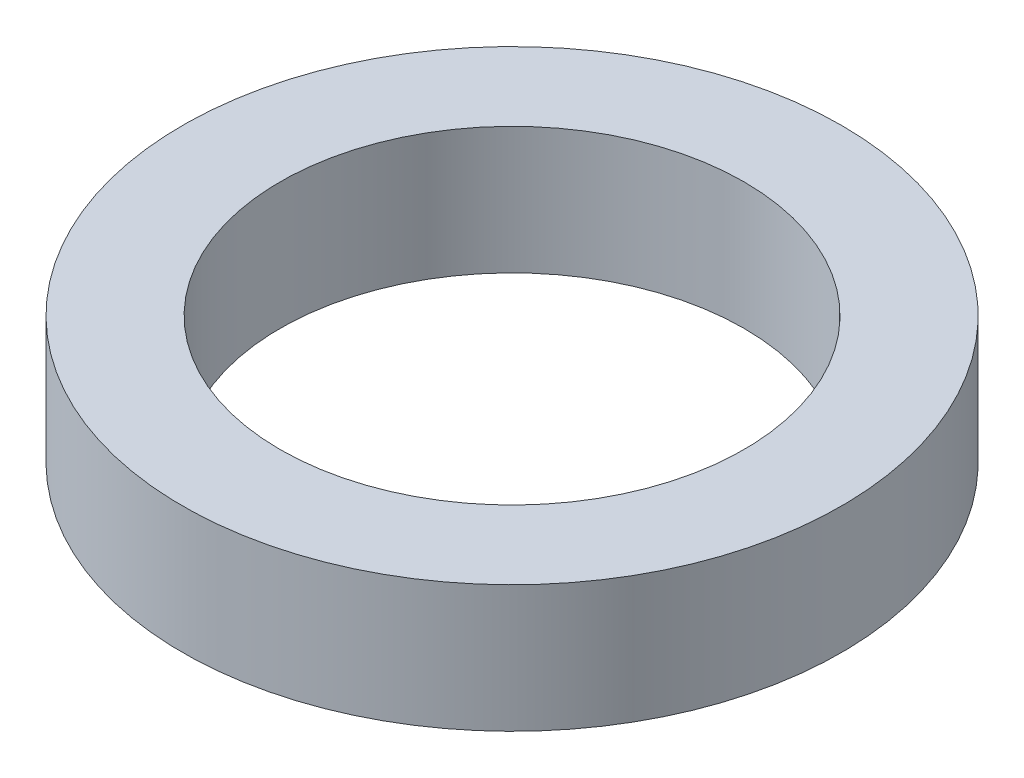
ISO-10303-21;
HEADER;
FILE_DESCRIPTION(('STEP AP214'),'2;1');
FILE_NAME('part.step','',(''),(''),'','','');
FILE_SCHEMA(('AUTOMOTIVE_DESIGN { 1 0 10303 214 1 1 1 1 }'));
ENDSEC;
DATA;
#1=APPLICATION_CONTEXT('core data for automotive mechanical design processes');
#2=APPLICATION_PROTOCOL_DEFINITION('international standard','automotive_design',2000,#1);
#3=PRODUCT_CONTEXT('',#1,'mechanical');
#4=PRODUCT('Part','Part','',(#3));
#5=PRODUCT_RELATED_PRODUCT_CATEGORY('part','',(#4));
#6=PRODUCT_DEFINITION_FORMATION('','',#4);
#7=PRODUCT_DEFINITION_CONTEXT('part definition',#1,'design');
#8=PRODUCT_DEFINITION('design','',#6,#7);
#9=PRODUCT_DEFINITION_SHAPE('','',#8);
#10=(LENGTH_UNIT() NAMED_UNIT(*) SI_UNIT(.MILLI.,.METRE.));
#11=(NAMED_UNIT(*) PLANE_ANGLE_UNIT() SI_UNIT($,.RADIAN.));
#12=(NAMED_UNIT(*) SI_UNIT($,.STERADIAN.) SOLID_ANGLE_UNIT());
#13=UNCERTAINTY_MEASURE_WITH_UNIT(LENGTH_MEASURE(1.E-05),#10,'distance_accuracy_value','');
#14=(GEOMETRIC_REPRESENTATION_CONTEXT(3) GLOBAL_UNCERTAINTY_ASSIGNED_CONTEXT((#13)) GLOBAL_UNIT_ASSIGNED_CONTEXT((#10,
#11,#12)) REPRESENTATION_CONTEXT('',''));
#15=CARTESIAN_POINT('',(0.,0.,0.));
#16=DIRECTION('',(0.,0.,1.));
#17=DIRECTION('',(1.,0.,0.));
#18=AXIS2_PLACEMENT_3D('',#15,#16,#17);
#19=CARTESIAN_POINT('',(0.,26.,0.));
#20=DIRECTION('',(0.,-1.,0.));
#21=DIRECTION('',(0.,0.,-1.));
#22=AXIS2_PLACEMENT_3D('',#19,#20,#21);
#23=CYLINDRICAL_SURFACE('',#22,67.5);
#24=CARTESIAN_POINT('',(0.,26.,0.));
#25=DIRECTION('',(0.,1.,0.));
#26=DIRECTION('',(0.,0.,1.));
#27=AXIS2_PLACEMENT_3D('',#24,#25,#26);
#28=CIRCLE('',#27,67.5);
#29=CARTESIAN_POINT('',(0.,26.,-67.5));
#30=VERTEX_POINT('',#29);
#31=EDGE_CURVE('E10',#30,#30,#28,.T.);
#32=CARTESIAN_POINT('',(0.,0.,0.));
#33=DIRECTION('',(0.,1.,0.));
#34=DIRECTION('',(0.,0.,1.));
#35=AXIS2_PLACEMENT_3D('',#32,#33,#34);
#36=CIRCLE('',#35,67.5);
#37=CARTESIAN_POINT('',(0.,0.,-67.5));
#38=VERTEX_POINT('',#37);
#39=EDGE_CURVE('E37',#38,#38,#36,.T.);
#40=CARTESIAN_POINT('',(0.,26.,-67.5));
#41=CARTESIAN_POINT('',(0.,25.7291666666667,-67.5));
#42=CARTESIAN_POINT('',(0.,25.4583333333333,-67.5));
#43=CARTESIAN_POINT('',(0.,24.9166666666667,-67.5));
#44=CARTESIAN_POINT('',(0.,24.6458333333333,-67.5));
#45=CARTESIAN_POINT('',(0.,24.1041666666667,-67.5));
#46=CARTESIAN_POINT('',(0.,23.8333333333333,-67.5));
#47=CARTESIAN_POINT('',(0.,23.2916666666667,-67.5));
#48=CARTESIAN_POINT('',(0.,23.0208333333333,-67.5));
#49=CARTESIAN_POINT('',(0.,22.4791666666667,-67.5));
#50=CARTESIAN_POINT('',(0.,22.2083333333333,-67.5));
#51=CARTESIAN_POINT('',(0.,21.6666666666667,-67.5));
#52=CARTESIAN_POINT('',(0.,21.3958333333333,-67.5));
#53=CARTESIAN_POINT('',(0.,20.8541666666667,-67.5));
#54=CARTESIAN_POINT('',(0.,20.5833333333333,-67.5));
#55=CARTESIAN_POINT('',(0.,20.0416666666667,-67.5));
#56=CARTESIAN_POINT('',(0.,19.7708333333333,-67.5));
#57=CARTESIAN_POINT('',(0.,19.2291666666667,-67.5));
#58=CARTESIAN_POINT('',(0.,18.9583333333333,-67.5));
#59=CARTESIAN_POINT('',(0.,18.4166666666667,-67.5));
#60=CARTESIAN_POINT('',(0.,18.1458333333333,-67.5));
#61=CARTESIAN_POINT('',(0.,17.6041666666667,-67.5));
#62=CARTESIAN_POINT('',(0.,17.3333333333333,-67.5));
#63=CARTESIAN_POINT('',(0.,16.7916666666667,-67.5));
#64=CARTESIAN_POINT('',(0.,16.5208333333333,-67.5));
#65=CARTESIAN_POINT('',(0.,15.9791666666667,-67.5));
#66=CARTESIAN_POINT('',(0.,15.7083333333333,-67.5));
#67=CARTESIAN_POINT('',(0.,15.1666666666667,-67.5));
#68=CARTESIAN_POINT('',(0.,14.8958333333333,-67.5));
#69=CARTESIAN_POINT('',(0.,14.3541666666667,-67.5));
#70=CARTESIAN_POINT('',(0.,14.0833333333333,-67.5));
#71=CARTESIAN_POINT('',(0.,13.5416666666667,-67.5));
#72=CARTESIAN_POINT('',(0.,13.2708333333333,-67.5));
#73=CARTESIAN_POINT('',(0.,12.7291666666667,-67.5));
#74=CARTESIAN_POINT('',(0.,12.4583333333333,-67.5));
#75=CARTESIAN_POINT('',(0.,11.9166666666667,-67.5));
#76=CARTESIAN_POINT('',(0.,11.6458333333333,-67.5));
#77=CARTESIAN_POINT('',(0.,11.1041666666667,-67.5));
#78=CARTESIAN_POINT('',(0.,10.8333333333333,-67.5));
#79=CARTESIAN_POINT('',(0.,10.2916666666667,-67.5));
#80=CARTESIAN_POINT('',(0.,10.0208333333333,-67.5));
#81=CARTESIAN_POINT('',(0.,9.47916666666667,-67.5));
#82=CARTESIAN_POINT('',(0.,9.20833333333333,-67.5));
#83=CARTESIAN_POINT('',(0.,8.66666666666667,-67.5));
#84=CARTESIAN_POINT('',(0.,8.39583333333333,-67.5));
#85=CARTESIAN_POINT('',(0.,7.85416666666667,-67.5));
#86=CARTESIAN_POINT('',(0.,7.58333333333333,-67.5));
#87=CARTESIAN_POINT('',(0.,7.04166666666667,-67.5));
#88=CARTESIAN_POINT('',(0.,6.77083333333333,-67.5));
#89=CARTESIAN_POINT('',(0.,6.22916666666667,-67.5));
#90=CARTESIAN_POINT('',(0.,5.95833333333333,-67.5));
#91=CARTESIAN_POINT('',(0.,5.41666666666667,-67.5));
#92=CARTESIAN_POINT('',(0.,5.14583333333333,-67.5));
#93=CARTESIAN_POINT('',(0.,4.60416666666667,-67.5));
#94=CARTESIAN_POINT('',(0.,4.33333333333333,-67.5));
#95=CARTESIAN_POINT('',(0.,3.79166666666667,-67.5));
#96=CARTESIAN_POINT('',(0.,3.52083333333333,-67.5));
#97=CARTESIAN_POINT('',(0.,2.97916666666667,-67.5));
#98=CARTESIAN_POINT('',(0.,2.70833333333333,-67.5));
#99=CARTESIAN_POINT('',(0.,2.16666666666667,-67.5));
#100=CARTESIAN_POINT('',(0.,1.89583333333333,-67.5));
#101=CARTESIAN_POINT('',(0.,1.35416666666667,-67.5));
#102=CARTESIAN_POINT('',(0.,1.08333333333333,-67.5));
#103=CARTESIAN_POINT('',(0.,0.541666666666667,-67.5));
#104=CARTESIAN_POINT('',(0.,0.270833333333334,-67.5));
#105=CARTESIAN_POINT('',(0.,0.,-67.5));
#106=B_SPLINE_CURVE_WITH_KNOTS('',3,(#40,#41,#42,#43,#44,#45,#46,#47,#48,#49,#50,#51,#52,#53,
#54,#55,#56,#57,#58,#59,#60,#61,#62,#63,#64,#65,#66,#67,#68,#69,#70,#71,#72,#73,#74,#75,#76,#77,
#78,#79,#80,#81,#82,#83,#84,#85,#86,#87,#88,#89,#90,#91,#92,#93,#94,#95,#96,#97,#98,#99,#100,
#101,#102,#103,#104,#105),.UNSPECIFIED.,.F.,.F.,(4,2,2,2,2,2,2,2,2,2,2,2,2,2,2,2,2,2,2,2,2,2,2,
2,2,2,2,2,2,2,2,2,4),(0.,0.812500000000001,1.625,2.4375,3.25,4.0625,4.875,5.6875,6.5,7.3125,
8.125,8.9375,9.75,10.5625,11.375,12.1875,13.,13.8125,14.625,15.4375,16.25,17.0625,17.875,
18.6875,19.5,20.3125,21.125,21.9375,22.75,23.5625,24.375,25.1875,26.),.UNSPECIFIED.);
#107=EDGE_CURVE('BSEAM40',#30,#38,#106,.T.);
#108=ORIENTED_EDGE('',*,*,#31,.F.);
#109=ORIENTED_EDGE('',*,*,#39,.T.);
#110=ORIENTED_EDGE('',*,*,#107,.T.);
#111=ORIENTED_EDGE('',*,*,#107,.F.);
#112=EDGE_LOOP('',(#108,#110,#109,#111));
#113=FACE_BOUND('',#112,.T.);
#114=ADVANCED_FACE('F40',(#113),#23,.T.);
#115=CARTESIAN_POINT('',(0.,26.,0.));
#116=DIRECTION('',(0.,1.,0.));
#117=DIRECTION('',(0.,0.,1.));
#118=AXIS2_PLACEMENT_3D('',#115,#116,#117);
#119=PLANE('',#118);
#120=CARTESIAN_POINT('',(0.,26.,0.));
#121=DIRECTION('',(0.,1.,0.));
#122=DIRECTION('',(0.,0.,1.));
#123=AXIS2_PLACEMENT_3D('',#120,#121,#122);
#124=CIRCLE('',#123,47.5);
#125=CARTESIAN_POINT('',(0.,26.,-47.5));
#126=VERTEX_POINT('',#125);
#127=EDGE_CURVE('E50',#126,#126,#124,.T.);
#128=ORIENTED_EDGE('',*,*,#127,.F.);
#129=EDGE_LOOP('',(#128));
#130=FACE_BOUND('',#129,.T.);
#131=ORIENTED_EDGE('',*,*,#31,.T.);
#132=EDGE_LOOP('',(#131));
#133=FACE_BOUND('',#132,.T.);
#134=ADVANCED_FACE('F59',(#130,#133),#119,.T.);
#135=CARTESIAN_POINT('',(0.,0.,0.));
#136=DIRECTION('',(0.,1.,0.));
#137=DIRECTION('',(0.,0.,1.));
#138=AXIS2_PLACEMENT_3D('',#135,#136,#137);
#139=PLANE('',#138);
#140=CARTESIAN_POINT('',(0.,0.,0.));
#141=DIRECTION('',(0.,1.,0.));
#142=DIRECTION('',(0.,0.,1.));
#143=AXIS2_PLACEMENT_3D('',#140,#141,#142);
#144=CIRCLE('',#143,47.5);
#145=CARTESIAN_POINT('',(0.,0.,-47.5));
#146=VERTEX_POINT('',#145);
#147=EDGE_CURVE('E47',#146,#146,#144,.T.);
#148=ORIENTED_EDGE('',*,*,#147,.T.);
#149=EDGE_LOOP('',(#148));
#150=FACE_BOUND('',#149,.T.);
#151=ORIENTED_EDGE('',*,*,#39,.F.);
#152=EDGE_LOOP('',(#151));
#153=FACE_BOUND('',#152,.T.);
#154=ADVANCED_FACE('F58',(#150,#153),#139,.F.);
#155=CARTESIAN_POINT('',(0.,26.,0.));
#156=DIRECTION('',(0.,-1.,0.));
#157=DIRECTION('',(0.,0.,-1.));
#158=AXIS2_PLACEMENT_3D('',#155,#156,#157);
#159=CYLINDRICAL_SURFACE('',#158,47.5);
#160=CARTESIAN_POINT('',(0.,26.,-47.5));
#161=CARTESIAN_POINT('',(0.,25.7291666666667,-47.5));
#162=CARTESIAN_POINT('',(0.,25.4583333333333,-47.5));
#163=CARTESIAN_POINT('',(0.,24.9166666666667,-47.5));
#164=CARTESIAN_POINT('',(0.,24.6458333333333,-47.5));
#165=CARTESIAN_POINT('',(0.,24.1041666666667,-47.5));
#166=CARTESIAN_POINT('',(0.,23.8333333333333,-47.5));
#167=CARTESIAN_POINT('',(0.,23.2916666666667,-47.5));
#168=CARTESIAN_POINT('',(0.,23.0208333333333,-47.5));
#169=CARTESIAN_POINT('',(0.,22.4791666666667,-47.5));
#170=CARTESIAN_POINT('',(0.,22.2083333333333,-47.5));
#171=CARTESIAN_POINT('',(0.,21.6666666666667,-47.5));
#172=CARTESIAN_POINT('',(0.,21.3958333333333,-47.5));
#173=CARTESIAN_POINT('',(0.,20.8541666666667,-47.5));
#174=CARTESIAN_POINT('',(0.,20.5833333333333,-47.5));
#175=CARTESIAN_POINT('',(0.,20.0416666666667,-47.5));
#176=CARTESIAN_POINT('',(0.,19.7708333333333,-47.5));
#177=CARTESIAN_POINT('',(0.,19.2291666666667,-47.5));
#178=CARTESIAN_POINT('',(0.,18.9583333333333,-47.5));
#179=CARTESIAN_POINT('',(0.,18.4166666666667,-47.5));
#180=CARTESIAN_POINT('',(0.,18.1458333333333,-47.5));
#181=CARTESIAN_POINT('',(0.,17.6041666666667,-47.5));
#182=CARTESIAN_POINT('',(0.,17.3333333333333,-47.5));
#183=CARTESIAN_POINT('',(0.,16.7916666666667,-47.5));
#184=CARTESIAN_POINT('',(0.,16.5208333333333,-47.5));
#185=CARTESIAN_POINT('',(0.,15.9791666666667,-47.5));
#186=CARTESIAN_POINT('',(0.,15.7083333333333,-47.5));
#187=CARTESIAN_POINT('',(0.,15.1666666666667,-47.5));
#188=CARTESIAN_POINT('',(0.,14.8958333333333,-47.5));
#189=CARTESIAN_POINT('',(0.,14.3541666666667,-47.5));
#190=CARTESIAN_POINT('',(0.,14.0833333333333,-47.5));
#191=CARTESIAN_POINT('',(0.,13.5416666666667,-47.5));
#192=CARTESIAN_POINT('',(0.,13.2708333333333,-47.5));
#193=CARTESIAN_POINT('',(0.,12.7291666666667,-47.5));
#194=CARTESIAN_POINT('',(0.,12.4583333333333,-47.5));
#195=CARTESIAN_POINT('',(0.,11.9166666666667,-47.5));
#196=CARTESIAN_POINT('',(0.,11.6458333333333,-47.5));
#197=CARTESIAN_POINT('',(0.,11.1041666666667,-47.5));
#198=CARTESIAN_POINT('',(0.,10.8333333333333,-47.5));
#199=CARTESIAN_POINT('',(0.,10.2916666666667,-47.5));
#200=CARTESIAN_POINT('',(0.,10.0208333333333,-47.5));
#201=CARTESIAN_POINT('',(0.,9.47916666666667,-47.5));
#202=CARTESIAN_POINT('',(0.,9.20833333333333,-47.5));
#203=CARTESIAN_POINT('',(0.,8.66666666666667,-47.5));
#204=CARTESIAN_POINT('',(0.,8.39583333333333,-47.5));
#205=CARTESIAN_POINT('',(0.,7.85416666666667,-47.5));
#206=CARTESIAN_POINT('',(0.,7.58333333333333,-47.5));
#207=CARTESIAN_POINT('',(0.,7.04166666666667,-47.5));
#208=CARTESIAN_POINT('',(0.,6.77083333333333,-47.5));
#209=CARTESIAN_POINT('',(0.,6.22916666666667,-47.5));
#210=CARTESIAN_POINT('',(0.,5.95833333333333,-47.5));
#211=CARTESIAN_POINT('',(0.,5.41666666666667,-47.5));
#212=CARTESIAN_POINT('',(0.,5.14583333333333,-47.5));
#213=CARTESIAN_POINT('',(0.,4.60416666666667,-47.5));
#214=CARTESIAN_POINT('',(0.,4.33333333333333,-47.5));
#215=CARTESIAN_POINT('',(0.,3.79166666666667,-47.5));
#216=CARTESIAN_POINT('',(0.,3.52083333333333,-47.5));
#217=CARTESIAN_POINT('',(0.,2.97916666666667,-47.5));
#218=CARTESIAN_POINT('',(0.,2.70833333333333,-47.5));
#219=CARTESIAN_POINT('',(0.,2.16666666666667,-47.5));
#220=CARTESIAN_POINT('',(0.,1.89583333333333,-47.5));
#221=CARTESIAN_POINT('',(0.,1.35416666666667,-47.5));
#222=CARTESIAN_POINT('',(0.,1.08333333333333,-47.5));
#223=CARTESIAN_POINT('',(0.,0.541666666666667,-47.5));
#224=CARTESIAN_POINT('',(0.,0.270833333333334,-47.5));
#225=CARTESIAN_POINT('',(0.,0.,-47.5));
#226=B_SPLINE_CURVE_WITH_KNOTS('',3,(#160,#161,#162,#163,#164,#165,#166,#167,#168,#169,#170,
#171,#172,#173,#174,#175,#176,#177,#178,#179,#180,#181,#182,#183,#184,#185,#186,#187,#188,#189,
#190,#191,#192,#193,#194,#195,#196,#197,#198,#199,#200,#201,#202,#203,#204,#205,#206,#207,#208,
#209,#210,#211,#212,#213,#214,#215,#216,#217,#218,#219,#220,#221,#222,#223,#224,#225),
.UNSPECIFIED.,.F.,.F.,(4,2,2,2,2,2,2,2,2,2,2,2,2,2,2,2,2,2,2,2,2,2,2,2,2,2,2,2,2,2,2,2,4),(0.,
0.812500000000001,1.625,2.4375,3.25,4.0625,4.875,5.6875,6.5,7.3125,8.125,8.9375,9.75,10.5625,
11.375,12.1875,13.,13.8125,14.625,15.4375,16.25,17.0625,17.875,18.6875,19.5,20.3125,21.125,
21.9375,22.75,23.5625,24.375,25.1875,26.),.UNSPECIFIED.);
#227=EDGE_CURVE('BSEAM54',#126,#146,#226,.T.);
#228=ORIENTED_EDGE('',*,*,#127,.T.);
#229=ORIENTED_EDGE('',*,*,#147,.F.);
#230=ORIENTED_EDGE('',*,*,#227,.T.);
#231=ORIENTED_EDGE('',*,*,#227,.F.);
#232=EDGE_LOOP('',(#228,#230,#229,#231));
#233=FACE_BOUND('',#232,.T.);
#234=ADVANCED_FACE('F54',(#233),#159,.F.);
#235=CLOSED_SHELL('',(#114,#134,#154,#234));
#236=MANIFOLD_SOLID_BREP('B2',#235);
#237=ADVANCED_BREP_SHAPE_REPRESENTATION('',(#18,#236),#14);
#238=SHAPE_DEFINITION_REPRESENTATION(#9,#237);
ENDSEC;
END-ISO-10303-21;
